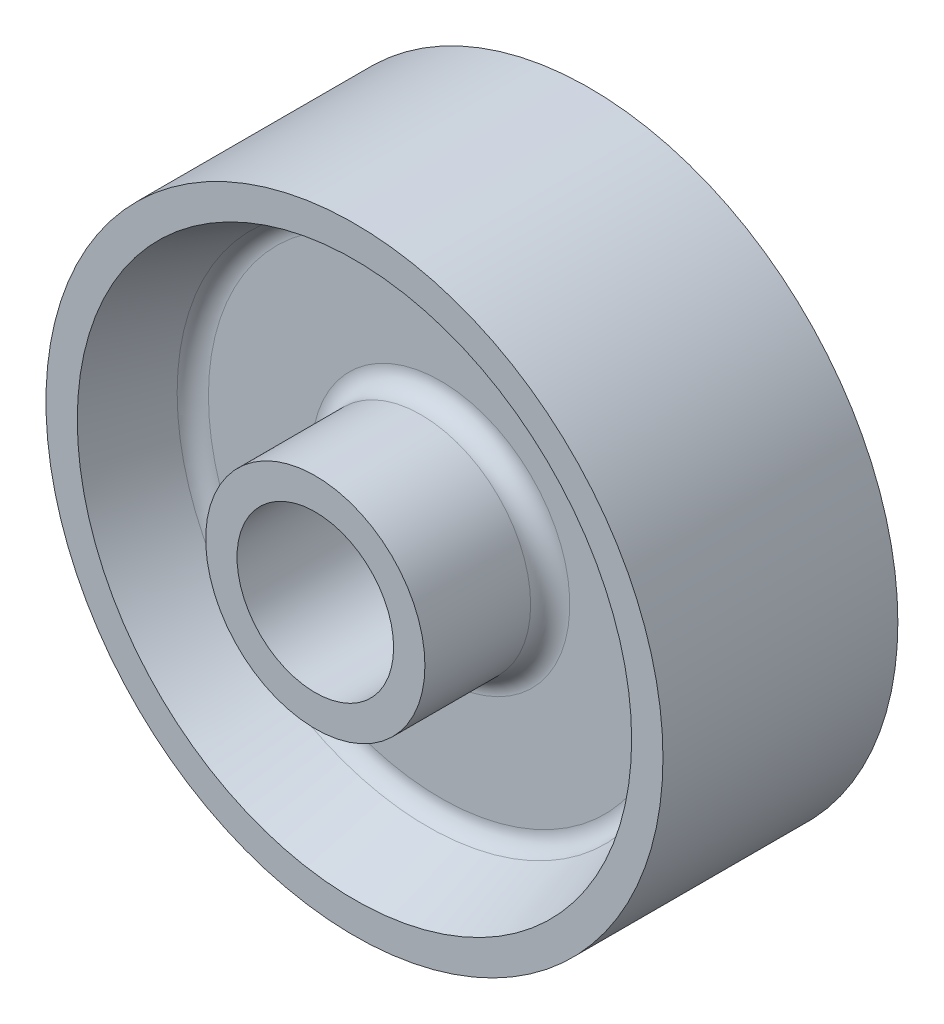
ISO-10303-21;
HEADER;
FILE_DESCRIPTION(('STEP AP214'),'2;1');
FILE_NAME('part.step','',(''),(''),'','','');
FILE_SCHEMA(('AUTOMOTIVE_DESIGN { 1 0 10303 214 1 1 1 1 }'));
ENDSEC;
DATA;
#1=APPLICATION_CONTEXT('core data for automotive mechanical design processes');
#2=APPLICATION_PROTOCOL_DEFINITION('international standard','automotive_design',2000,#1);
#3=PRODUCT_CONTEXT('',#1,'mechanical');
#4=PRODUCT('Part','Part','',(#3));
#5=PRODUCT_RELATED_PRODUCT_CATEGORY('part','',(#4));
#6=PRODUCT_DEFINITION_FORMATION('','',#4);
#7=PRODUCT_DEFINITION_CONTEXT('part definition',#1,'design');
#8=PRODUCT_DEFINITION('design','',#6,#7);
#9=PRODUCT_DEFINITION_SHAPE('','',#8);
#10=(LENGTH_UNIT() NAMED_UNIT(*) SI_UNIT(.MILLI.,.METRE.));
#11=(NAMED_UNIT(*) PLANE_ANGLE_UNIT() SI_UNIT($,.RADIAN.));
#12=(NAMED_UNIT(*) SI_UNIT($,.STERADIAN.) SOLID_ANGLE_UNIT());
#13=UNCERTAINTY_MEASURE_WITH_UNIT(LENGTH_MEASURE(1.E-05),#10,'distance_accuracy_value','');
#14=(GEOMETRIC_REPRESENTATION_CONTEXT(3) GLOBAL_UNCERTAINTY_ASSIGNED_CONTEXT((#13)) GLOBAL_UNIT_ASSIGNED_CONTEXT((#10,
#11,#12)) REPRESENTATION_CONTEXT('',''));
#15=CARTESIAN_POINT('',(0.,0.,0.));
#16=DIRECTION('',(0.,0.,1.));
#17=DIRECTION('',(1.,0.,0.));
#18=AXIS2_PLACEMENT_3D('',#15,#16,#17);
#19=CARTESIAN_POINT('',(0.,0.,-8.255));
#20=DIRECTION('',(0.,0.,1.));
#21=DIRECTION('',(1.,0.,0.));
#22=AXIS2_PLACEMENT_3D('',#19,#20,#21);
#23=TOROIDAL_SURFACE('',#22,37.6541434348605,3.175);
#24=CARTESIAN_POINT('',(0.,0.,-5.07999999999999));
#25=DIRECTION('',(0.,0.,1.));
#26=DIRECTION('',(1.,0.,0.));
#27=AXIS2_PLACEMENT_3D('',#24,#25,#26);
#28=CIRCLE('',#27,37.6541434348605);
#29=CARTESIAN_POINT('',(37.6541434348605,0.,-5.07999999999999));
#30=VERTEX_POINT('',#29);
#31=EDGE_CURVE('E44',#30,#30,#28,.F.);
#32=ORIENTED_EDGE('',*,*,#31,.F.);
#33=EDGE_LOOP('',(#32));
#34=FACE_BOUND('',#33,.T.);
#35=CARTESIAN_POINT('',(0.,0.,-7.16996577469971));
#36=DIRECTION('',(0.,0.,-1.));
#37=DIRECTION('',(-1.,0.,0.));
#38=AXIS2_PLACEMENT_3D('',#35,#36,#37);
#39=CIRCLE('',#38,40.6379875544363);
#40=CARTESIAN_POINT('',(-40.6379875544363,0.,-7.16996577469971));
#41=VERTEX_POINT('',#40);
#42=EDGE_CURVE('E10',#41,#41,#39,.F.);
#43=ORIENTED_EDGE('',*,*,#42,.F.);
#44=EDGE_LOOP('',(#43));
#45=FACE_BOUND('',#44,.T.);
#46=ADVANCED_FACE('F37',(#34,#45),#23,.F.);
#47=CARTESIAN_POINT('',(0.,0.,-8.255));
#48=DIRECTION('',(0.,0.,1.));
#49=DIRECTION('',(1.,0.,0.));
#50=AXIS2_PLACEMENT_3D('',#47,#48,#49);
#51=TOROIDAL_SURFACE('',#50,20.955,3.175);
#52=CARTESIAN_POINT('',(0.,0.,-5.07999999999999));
#53=DIRECTION('',(0.,0.,1.));
#54=DIRECTION('',(1.,0.,0.));
#55=AXIS2_PLACEMENT_3D('',#52,#53,#54);
#56=CIRCLE('',#55,20.955);
#57=CARTESIAN_POINT('',(20.955,0.,-5.07999999999999));
#58=VERTEX_POINT('',#57);
#59=EDGE_CURVE('E54',#58,#58,#56,.T.);
#60=ORIENTED_EDGE('',*,*,#59,.F.);
#61=EDGE_LOOP('',(#60));
#62=FACE_BOUND('',#61,.T.);
#63=CARTESIAN_POINT('',(0.,0.,-8.255));
#64=DIRECTION('',(0.,0.,1.));
#65=DIRECTION('',(1.,0.,0.));
#66=AXIS2_PLACEMENT_3D('',#63,#64,#65);
#67=CIRCLE('',#66,17.78);
#68=CARTESIAN_POINT('',(17.78,0.,-8.255));
#69=VERTEX_POINT('',#68);
#70=EDGE_CURVE('E49',#69,#69,#67,.F.);
#71=ORIENTED_EDGE('',*,*,#70,.F.);
#72=EDGE_LOOP('',(#71));
#73=FACE_BOUND('',#72,.T.);
#74=ADVANCED_FACE('F123',(#62,#73),#51,.F.);
#75=CARTESIAN_POINT('',(0.,0.,8.255));
#76=DIRECTION('',(0.,0.,-1.));
#77=DIRECTION('',(-1.,0.,0.));
#78=AXIS2_PLACEMENT_3D('',#75,#76,#77);
#79=TOROIDAL_SURFACE('',#78,37.6541434348605,3.175);
#80=CARTESIAN_POINT('',(0.,0.,5.08));
#81=DIRECTION('',(0.,0.,-1.));
#82=DIRECTION('',(-1.,0.,0.));
#83=AXIS2_PLACEMENT_3D('',#80,#81,#82);
#84=CIRCLE('',#83,37.6541434348605);
#85=CARTESIAN_POINT('',(-37.6541434348605,0.,5.08));
#86=VERTEX_POINT('',#85);
#87=EDGE_CURVE('E64',#86,#86,#84,.F.);
#88=ORIENTED_EDGE('',*,*,#87,.F.);
#89=EDGE_LOOP('',(#88));
#90=FACE_BOUND('',#89,.T.);
#91=CARTESIAN_POINT('',(0.,0.,7.16996577469971));
#92=DIRECTION('',(0.,0.,1.));
#93=DIRECTION('',(1.,0.,0.));
#94=AXIS2_PLACEMENT_3D('',#91,#92,#93);
#95=CIRCLE('',#94,40.6379875544363);
#96=CARTESIAN_POINT('',(40.6379875544363,0.,7.16996577469971));
#97=VERTEX_POINT('',#96);
#98=EDGE_CURVE('E60',#97,#97,#95,.F.);
#99=ORIENTED_EDGE('',*,*,#98,.F.);
#100=EDGE_LOOP('',(#99));
#101=FACE_BOUND('',#100,.T.);
#102=ADVANCED_FACE('F128',(#90,#101),#79,.F.);
#103=CARTESIAN_POINT('',(0.,0.,8.255));
#104=DIRECTION('',(0.,0.,-1.));
#105=DIRECTION('',(-1.,0.,0.));
#106=AXIS2_PLACEMENT_3D('',#103,#104,#105);
#107=TOROIDAL_SURFACE('',#106,20.955,3.175);
#108=CARTESIAN_POINT('',(0.,0.,5.08));
#109=DIRECTION('',(0.,0.,-1.));
#110=DIRECTION('',(-1.,0.,0.));
#111=AXIS2_PLACEMENT_3D('',#108,#109,#110);
#112=CIRCLE('',#111,20.955);
#113=CARTESIAN_POINT('',(-20.955,0.,5.08));
#114=VERTEX_POINT('',#113);
#115=EDGE_CURVE('E72',#114,#114,#112,.T.);
#116=ORIENTED_EDGE('',*,*,#115,.F.);
#117=EDGE_LOOP('',(#116));
#118=FACE_BOUND('',#117,.T.);
#119=CARTESIAN_POINT('',(0.,0.,8.255));
#120=DIRECTION('',(0.,0.,-1.));
#121=DIRECTION('',(-1.,0.,0.));
#122=AXIS2_PLACEMENT_3D('',#119,#120,#121);
#123=CIRCLE('',#122,17.78);
#124=CARTESIAN_POINT('',(-17.78,0.,8.255));
#125=VERTEX_POINT('',#124);
#126=EDGE_CURVE('E68',#125,#125,#123,.F.);
#127=ORIENTED_EDGE('',*,*,#126,.F.);
#128=EDGE_LOOP('',(#127));
#129=FACE_BOUND('',#128,.T.);
#130=ADVANCED_FACE('F134',(#118,#129),#107,.F.);
#131=CARTESIAN_POINT('',(0.,17.78,25.4));
#132=DIRECTION('',(0.,0.,-1.));
#133=DIRECTION('',(-1.,0.,0.));
#134=AXIS2_PLACEMENT_3D('',#131,#132,#133);
#135=PLANE('',#134);
#136=CARTESIAN_POINT('',(0.,0.,25.4));
#137=DIRECTION('',(0.,0.,1.));
#138=DIRECTION('',(1.,0.,0.));
#139=AXIS2_PLACEMENT_3D('',#136,#137,#138);
#140=CIRCLE('',#139,12.7);
#141=CARTESIAN_POINT('',(12.7,0.,25.4));
#142=VERTEX_POINT('',#141);
#143=EDGE_CURVE('E76',#142,#142,#140,.T.);
#144=ORIENTED_EDGE('',*,*,#143,.F.);
#145=EDGE_LOOP('',(#144));
#146=FACE_BOUND('',#145,.T.);
#147=CARTESIAN_POINT('',(0.,0.,25.4));
#148=DIRECTION('',(0.,0.,1.));
#149=DIRECTION('',(1.,0.,0.));
#150=AXIS2_PLACEMENT_3D('',#147,#148,#149);
#151=CIRCLE('',#150,17.78);
#152=CARTESIAN_POINT('',(17.78,0.,25.4));
#153=VERTEX_POINT('',#152);
#154=EDGE_CURVE('E104',#153,#153,#151,.T.);
#155=ORIENTED_EDGE('',*,*,#154,.T.);
#156=EDGE_LOOP('',(#155));
#157=FACE_BOUND('',#156,.T.);
#158=ADVANCED_FACE('F109',(#146,#157),#135,.F.);
#159=CARTESIAN_POINT('',(0.,0.,55.673126484457));
#160=DIRECTION('',(0.,0.,1.));
#161=DIRECTION('',(1.,0.,0.));
#162=AXIS2_PLACEMENT_3D('',#159,#160,#161);
#163=CYLINDRICAL_SURFACE('',#162,12.7);
#164=CARTESIAN_POINT('',(0.,0.,-25.4));
#165=DIRECTION('',(0.,0.,1.));
#166=DIRECTION('',(1.,0.,0.));
#167=AXIS2_PLACEMENT_3D('',#164,#165,#166);
#168=CIRCLE('',#167,12.7);
#169=CARTESIAN_POINT('',(12.7,0.,-25.4));
#170=VERTEX_POINT('',#169);
#171=EDGE_CURVE('E80',#170,#170,#168,.T.);
#172=ORIENTED_EDGE('',*,*,#171,.F.);
#173=EDGE_LOOP('',(#172));
#174=FACE_BOUND('',#173,.T.);
#175=ORIENTED_EDGE('',*,*,#143,.T.);
#176=EDGE_LOOP('',(#175));
#177=FACE_BOUND('',#176,.T.);
#178=ADVANCED_FACE('F145',(#174,#177),#163,.F.);
#179=CARTESIAN_POINT('',(0.,12.7,-25.4));
#180=DIRECTION('',(0.,0.,1.));
#181=DIRECTION('',(1.,0.,0.));
#182=AXIS2_PLACEMENT_3D('',#179,#180,#181);
#183=PLANE('',#182);
#184=CARTESIAN_POINT('',(0.,0.,-25.4));
#185=DIRECTION('',(0.,0.,1.));
#186=DIRECTION('',(1.,0.,0.));
#187=AXIS2_PLACEMENT_3D('',#184,#185,#186);
#188=CIRCLE('',#187,17.78);
#189=CARTESIAN_POINT('',(17.78,0.,-25.4));
#190=VERTEX_POINT('',#189);
#191=EDGE_CURVE('E84',#190,#190,#188,.T.);
#192=ORIENTED_EDGE('',*,*,#191,.F.);
#193=EDGE_LOOP('',(#192));
#194=FACE_BOUND('',#193,.T.);
#195=ORIENTED_EDGE('',*,*,#171,.T.);
#196=EDGE_LOOP('',(#195));
#197=FACE_BOUND('',#196,.T.);
#198=ADVANCED_FACE('F149',(#194,#197),#183,.F.);
#199=CARTESIAN_POINT('',(0.,0.,55.673126484457));
#200=DIRECTION('',(0.,0.,1.));
#201=DIRECTION('',(1.,0.,0.));
#202=AXIS2_PLACEMENT_3D('',#199,#200,#201);
#203=CYLINDRICAL_SURFACE('',#202,17.78);
#204=ORIENTED_EDGE('',*,*,#70,.T.);
#205=EDGE_LOOP('',(#204));
#206=FACE_BOUND('',#205,.T.);
#207=ORIENTED_EDGE('',*,*,#191,.T.);
#208=EDGE_LOOP('',(#207));
#209=FACE_BOUND('',#208,.T.);
#210=ADVANCED_FACE('F153',(#206,#209),#203,.T.);
#211=CARTESIAN_POINT('',(0.,17.78,-5.07999999999999));
#212=DIRECTION('',(0.,0.,1.));
#213=DIRECTION('',(1.,0.,0.));
#214=AXIS2_PLACEMENT_3D('',#211,#212,#213);
#215=PLANE('',#214);
#216=ORIENTED_EDGE('',*,*,#31,.T.);
#217=EDGE_LOOP('',(#216));
#218=FACE_BOUND('',#217,.T.);
#219=ORIENTED_EDGE('',*,*,#59,.T.);
#220=EDGE_LOOP('',(#219));
#221=FACE_BOUND('',#220,.T.);
#222=ADVANCED_FACE('F157',(#218,#221),#215,.F.);
#223=CARTESIAN_POINT('',(0.,0.,-5.07999999999999));
#224=DIRECTION('',(0.,0.,-1.));
#225=DIRECTION('',(-1.,0.,0.));
#226=AXIS2_PLACEMENT_3D('',#223,#224,#225);
#227=CONICAL_SURFACE('',#226,39.878,0.348771003583907);
#228=ORIENTED_EDGE('',*,*,#42,.T.);
#229=EDGE_LOOP('',(#228));
#230=FACE_BOUND('',#229,.T.);
#231=CARTESIAN_POINT('',(0.,0.,-19.05));
#232=DIRECTION('',(0.,0.,1.));
#233=DIRECTION('',(1.,0.,0.));
#234=AXIS2_PLACEMENT_3D('',#231,#232,#233);
#235=CIRCLE('',#234,44.958);
#236=CARTESIAN_POINT('',(44.958,0.,-19.05));
#237=VERTEX_POINT('',#236);
#238=EDGE_CURVE('E88',#237,#237,#235,.T.);
#239=ORIENTED_EDGE('',*,*,#238,.F.);
#240=EDGE_LOOP('',(#239));
#241=FACE_BOUND('',#240,.T.);
#242=ADVANCED_FACE('F161',(#230,#241),#227,.F.);
#243=CARTESIAN_POINT('',(0.,44.958,-19.05));
#244=DIRECTION('',(0.,0.,1.));
#245=DIRECTION('',(1.,0.,0.));
#246=AXIS2_PLACEMENT_3D('',#243,#244,#245);
#247=PLANE('',#246);
#248=CARTESIAN_POINT('',(0.,0.,-19.05));
#249=DIRECTION('',(0.,0.,1.));
#250=DIRECTION('',(1.,0.,0.));
#251=AXIS2_PLACEMENT_3D('',#248,#249,#250);
#252=CIRCLE('',#251,50.038);
#253=CARTESIAN_POINT('',(50.038,0.,-19.05));
#254=VERTEX_POINT('',#253);
#255=EDGE_CURVE('E92',#254,#254,#252,.T.);
#256=ORIENTED_EDGE('',*,*,#255,.F.);
#257=EDGE_LOOP('',(#256));
#258=FACE_BOUND('',#257,.T.);
#259=ORIENTED_EDGE('',*,*,#238,.T.);
#260=EDGE_LOOP('',(#259));
#261=FACE_BOUND('',#260,.T.);
#262=ADVANCED_FACE('F164',(#258,#261),#247,.F.);
#263=CARTESIAN_POINT('',(0.,0.,55.673126484457));
#264=DIRECTION('',(0.,0.,1.));
#265=DIRECTION('',(1.,0.,0.));
#266=AXIS2_PLACEMENT_3D('',#263,#264,#265);
#267=CYLINDRICAL_SURFACE('',#266,50.038);
#268=CARTESIAN_POINT('',(0.,0.,19.05));
#269=DIRECTION('',(0.,0.,1.));
#270=DIRECTION('',(1.,0.,0.));
#271=AXIS2_PLACEMENT_3D('',#268,#269,#270);
#272=CIRCLE('',#271,50.038);
#273=CARTESIAN_POINT('',(50.038,0.,19.05));
#274=VERTEX_POINT('',#273);
#275=EDGE_CURVE('E96',#274,#274,#272,.T.);
#276=ORIENTED_EDGE('',*,*,#275,.F.);
#277=EDGE_LOOP('',(#276));
#278=FACE_BOUND('',#277,.T.);
#279=ORIENTED_EDGE('',*,*,#255,.T.);
#280=EDGE_LOOP('',(#279));
#281=FACE_BOUND('',#280,.T.);
#282=ADVANCED_FACE('F167',(#278,#281),#267,.T.);
#283=CARTESIAN_POINT('',(0.,50.038,19.05));
#284=DIRECTION('',(0.,0.,-1.));
#285=DIRECTION('',(-1.,0.,0.));
#286=AXIS2_PLACEMENT_3D('',#283,#284,#285);
#287=PLANE('',#286);
#288=CARTESIAN_POINT('',(0.,0.,19.05));
#289=DIRECTION('',(0.,0.,1.));
#290=DIRECTION('',(1.,0.,0.));
#291=AXIS2_PLACEMENT_3D('',#288,#289,#290);
#292=CIRCLE('',#291,44.958);
#293=CARTESIAN_POINT('',(44.958,0.,19.05));
#294=VERTEX_POINT('',#293);
#295=EDGE_CURVE('E100',#294,#294,#292,.T.);
#296=ORIENTED_EDGE('',*,*,#295,.F.);
#297=EDGE_LOOP('',(#296));
#298=FACE_BOUND('',#297,.T.);
#299=ORIENTED_EDGE('',*,*,#275,.T.);
#300=EDGE_LOOP('',(#299));
#301=FACE_BOUND('',#300,.T.);
#302=ADVANCED_FACE('F171',(#298,#301),#287,.F.);
#303=CARTESIAN_POINT('',(0.,0.,19.05));
#304=DIRECTION('',(0.,0.,1.));
#305=DIRECTION('',(1.,0.,0.));
#306=AXIS2_PLACEMENT_3D('',#303,#304,#305);
#307=CONICAL_SURFACE('',#306,44.958,0.348771003583906);
#308=ORIENTED_EDGE('',*,*,#98,.T.);
#309=EDGE_LOOP('',(#308));
#310=FACE_BOUND('',#309,.T.);
#311=ORIENTED_EDGE('',*,*,#295,.T.);
#312=EDGE_LOOP('',(#311));
#313=FACE_BOUND('',#312,.T.);
#314=ADVANCED_FACE('F119',(#310,#313),#307,.F.);
#315=CARTESIAN_POINT('',(0.,39.878,5.08));
#316=DIRECTION('',(0.,0.,-1.));
#317=DIRECTION('',(-1.,0.,0.));
#318=AXIS2_PLACEMENT_3D('',#315,#316,#317);
#319=PLANE('',#318);
#320=ORIENTED_EDGE('',*,*,#87,.T.);
#321=EDGE_LOOP('',(#320));
#322=FACE_BOUND('',#321,.T.);
#323=ORIENTED_EDGE('',*,*,#115,.T.);
#324=EDGE_LOOP('',(#323));
#325=FACE_BOUND('',#324,.T.);
#326=ADVANCED_FACE('F113',(#322,#325),#319,.F.);
#327=CARTESIAN_POINT('',(0.,0.,55.673126484457));
#328=DIRECTION('',(0.,0.,1.));
#329=DIRECTION('',(1.,0.,0.));
#330=AXIS2_PLACEMENT_3D('',#327,#328,#329);
#331=CYLINDRICAL_SURFACE('',#330,17.78);
#332=ORIENTED_EDGE('',*,*,#126,.T.);
#333=EDGE_LOOP('',(#332));
#334=FACE_BOUND('',#333,.T.);
#335=ORIENTED_EDGE('',*,*,#154,.F.);
#336=EDGE_LOOP('',(#335));
#337=FACE_BOUND('',#336,.T.);
#338=ADVANCED_FACE('F111',(#334,#337),#331,.T.);
#339=CLOSED_SHELL('',(#46,#74,#102,#130,#158,#178,#198,#210,#222,#242,#262,#282,#302,#314,#326,#338));
#340=MANIFOLD_SOLID_BREP('B2',#339);
#341=ADVANCED_BREP_SHAPE_REPRESENTATION('',(#18,#340),#14);
#342=SHAPE_DEFINITION_REPRESENTATION(#9,#341);
ENDSEC;
END-ISO-10303-21;
